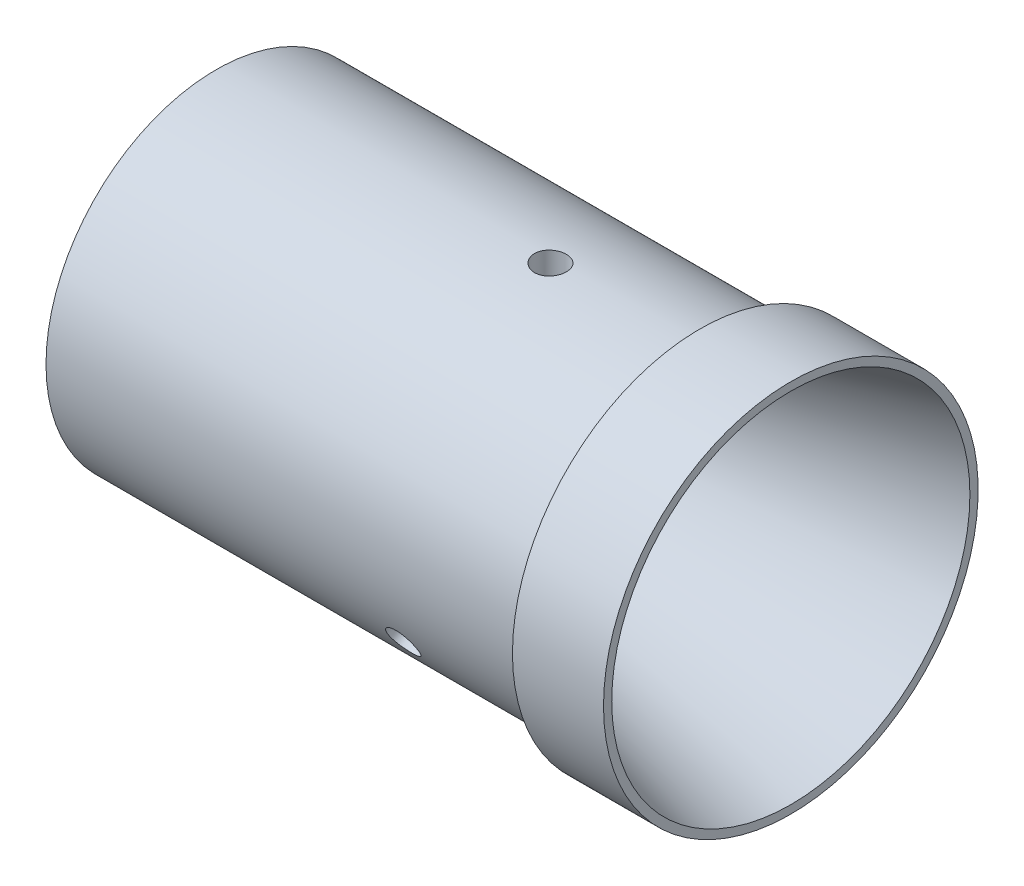
ISO-10303-21;
HEADER;
FILE_DESCRIPTION(('STEP AP214'),'2;1');
FILE_NAME('part.step','',(''),(''),'','','');
FILE_SCHEMA(('AUTOMOTIVE_DESIGN { 1 0 10303 214 1 1 1 1 }'));
ENDSEC;
DATA;
#1=APPLICATION_CONTEXT('core data for automotive mechanical design processes');
#2=APPLICATION_PROTOCOL_DEFINITION('international standard','automotive_design',2000,#1);
#3=PRODUCT_CONTEXT('',#1,'mechanical');
#4=PRODUCT('Part','Part','',(#3));
#5=PRODUCT_RELATED_PRODUCT_CATEGORY('part','',(#4));
#6=PRODUCT_DEFINITION_FORMATION('','',#4);
#7=PRODUCT_DEFINITION_CONTEXT('part definition',#1,'design');
#8=PRODUCT_DEFINITION('design','',#6,#7);
#9=PRODUCT_DEFINITION_SHAPE('','',#8);
#10=(LENGTH_UNIT() NAMED_UNIT(*) SI_UNIT(.MILLI.,.METRE.));
#11=(NAMED_UNIT(*) PLANE_ANGLE_UNIT() SI_UNIT($,.RADIAN.));
#12=(NAMED_UNIT(*) SI_UNIT($,.STERADIAN.) SOLID_ANGLE_UNIT());
#13=UNCERTAINTY_MEASURE_WITH_UNIT(LENGTH_MEASURE(1.E-05),#10,'distance_accuracy_value','');
#14=(GEOMETRIC_REPRESENTATION_CONTEXT(3) GLOBAL_UNCERTAINTY_ASSIGNED_CONTEXT((#13)) GLOBAL_UNIT_ASSIGNED_CONTEXT((#10,
#11,#12)) REPRESENTATION_CONTEXT('',''));
#15=CARTESIAN_POINT('',(0.,0.,0.));
#16=DIRECTION('',(0.,0.,1.));
#17=DIRECTION('',(1.,0.,0.));
#18=AXIS2_PLACEMENT_3D('',#15,#16,#17);
#19=CARTESIAN_POINT('',(0.,0.,0.));
#20=DIRECTION('',(-1.,0.,0.));
#21=DIRECTION('',(0.,0.,1.));
#22=AXIS2_PLACEMENT_3D('',#19,#20,#21);
#23=CYLINDRICAL_SURFACE('',#22,12.7);
#24=CARTESIAN_POINT('',(5.842,0.,0.));
#25=DIRECTION('',(-1.,0.,0.));
#26=DIRECTION('',(0.,0.,1.));
#27=AXIS2_PLACEMENT_3D('',#24,#25,#26);
#28=CIRCLE('',#27,12.7);
#29=CARTESIAN_POINT('',(5.842,0.,12.7));
#30=VERTEX_POINT('',#29);
#31=EDGE_CURVE('E90',#30,#30,#28,.T.);
#32=ORIENTED_EDGE('',*,*,#31,.F.);
#33=EDGE_LOOP('',(#32));
#34=FACE_BOUND('',#33,.T.);
#35=CARTESIAN_POINT('',(0.,0.,0.));
#36=DIRECTION('',(-1.,0.,0.));
#37=DIRECTION('',(0.,0.,1.));
#38=AXIS2_PLACEMENT_3D('',#35,#36,#37);
#39=CIRCLE('',#38,12.7);
#40=CARTESIAN_POINT('',(0.,0.,12.7));
#41=VERTEX_POINT('',#40);
#42=EDGE_CURVE('E134',#41,#41,#39,.T.);
#43=ORIENTED_EDGE('',*,*,#42,.T.);
#44=EDGE_LOOP('',(#43));
#45=FACE_BOUND('',#44,.T.);
#46=ADVANCED_FACE('F47',(#34,#45),#23,.F.);
#47=CARTESIAN_POINT('',(0.,12.7,0.));
#48=DIRECTION('',(1.,0.,0.));
#49=DIRECTION('',(0.,0.,-1.));
#50=AXIS2_PLACEMENT_3D('',#47,#48,#49);
#51=PLANE('',#50);
#52=ORIENTED_EDGE('',*,*,#42,.F.);
#53=EDGE_LOOP('',(#52));
#54=FACE_BOUND('',#53,.T.);
#55=CARTESIAN_POINT('',(0.,0.,0.));
#56=DIRECTION('',(-1.,0.,0.));
#57=DIRECTION('',(0.,0.,1.));
#58=AXIS2_PLACEMENT_3D('',#55,#56,#57);
#59=CIRCLE('',#58,14.478);
#60=CARTESIAN_POINT('',(0.,0.,14.478));
#61=VERTEX_POINT('',#60);
#62=EDGE_CURVE('E130',#61,#61,#59,.T.);
#63=ORIENTED_EDGE('',*,*,#62,.T.);
#64=EDGE_LOOP('',(#63));
#65=FACE_BOUND('',#64,.T.);
#66=ADVANCED_FACE('F200',(#54,#65),#51,.F.);
#67=CARTESIAN_POINT('',(0.,0.,0.));
#68=DIRECTION('',(-1.,0.,0.));
#69=DIRECTION('',(0.,0.,1.));
#70=AXIS2_PLACEMENT_3D('',#67,#68,#69);
#71=CYLINDRICAL_SURFACE('',#70,14.478);
#72=CARTESIAN_POINT('',(28.448,-6.0359989529651,-13.1597568609684));
#73=CARTESIAN_POINT('',(28.3722047397897,-6.03600222356383,-13.1597559353135));
#74=CARTESIAN_POINT('',(28.2963587451566,-6.0418372883581,-13.1570838354711));
#75=CARTESIAN_POINT('',(28.1467678224753,-6.0650023513697,-13.1464210636841));
#76=CARTESIAN_POINT('',(28.0730253327703,-6.08234516606279,-13.1384244616707));
#77=CARTESIAN_POINT('',(27.9298294946994,-6.12794358838118,-13.1172184468049));
#78=CARTESIAN_POINT('',(27.8603736442676,-6.15619275885688,-13.1040121087431));
#79=CARTESIAN_POINT('',(27.7276780805905,-6.22267691682936,-13.0725713496797));
#80=CARTESIAN_POINT('',(27.6644370971785,-6.26090985802163,-13.0543379589957));
#81=CARTESIAN_POINT('',(27.5457489932479,-6.34626767215661,-13.0130556718049));
#82=CARTESIAN_POINT('',(27.4903244747192,-6.3934174444241,-12.9899932709795));
#83=CARTESIAN_POINT('',(27.3890370498499,-6.49506304040762,-12.9394688676086));
#84=CARTESIAN_POINT('',(27.343174572689,-6.54955919367555,-12.9120066676819));
#85=CARTESIAN_POINT('',(27.262236040223,-6.66432701036899,-12.853147074866));
#86=CARTESIAN_POINT('',(27.2271798261091,-6.72460903423385,-12.8217425905885));
#87=CARTESIAN_POINT('',(27.1689758571841,-6.84903383866193,-12.7557114492584));
#88=CARTESIAN_POINT('',(27.1458278462284,-6.91317653614919,-12.7210848615319));
#89=CARTESIAN_POINT('',(27.1121632143776,-7.04321471183353,-12.6495493323078));
#90=CARTESIAN_POINT('',(27.1016096676814,-7.10910448420485,-12.6126473981588));
#91=CARTESIAN_POINT('',(27.0933193290292,-7.24089476748408,-12.5374511598312));
#92=CARTESIAN_POINT('',(27.0955822438438,-7.30679527811181,-12.4991568875279));
#93=CARTESIAN_POINT('',(27.1128305252929,-7.4365297035967,-12.4224061558767));
#94=CARTESIAN_POINT('',(27.1277761851088,-7.50036942352727,-12.3839505750324));
#95=CARTESIAN_POINT('',(27.1699038948802,-7.62444950196837,-12.3079466479785));
#96=CARTESIAN_POINT('',(27.197086086293,-7.68468981885981,-12.270398312262));
#97=CARTESIAN_POINT('',(27.2629590918541,-7.80006754889445,-12.1973810166705));
#98=CARTESIAN_POINT('',(27.3016675650954,-7.85519696057067,-12.1619153481375));
#99=CARTESIAN_POINT('',(27.389481521266,-7.95883902614255,-12.0943457366585));
#100=CARTESIAN_POINT('',(27.4385872700151,-8.00735151081578,-12.062241879693));
#101=CARTESIAN_POINT('',(27.5460253567886,-8.09672468071775,-12.0024348501245));
#102=CARTESIAN_POINT('',(27.6043922201156,-8.13755543151054,-11.9747489546672));
#103=CARTESIAN_POINT('',(27.72857575616,-8.2103314930062,-11.9249692258591));
#104=CARTESIAN_POINT('',(27.7943924375597,-8.24227679335358,-11.9028753990255));
#105=CARTESIAN_POINT('',(27.9316329222978,-8.29650847506884,-11.8651391972121));
#106=CARTESIAN_POINT('',(28.0030576872199,-8.31879319570579,-11.8494979315015));
#107=CARTESIAN_POINT('',(28.1494743726703,-8.35315136005179,-11.825303033636));
#108=CARTESIAN_POINT('',(28.2244661985507,-8.36522507453888,-11.8167492135345));
#109=CARTESIAN_POINT('',(28.3755852513339,-8.37884071892452,-11.8070988365785));
#110=CARTESIAN_POINT('',(28.4517071245171,-8.38042222750482,-11.8059742552298));
#111=CARTESIAN_POINT('',(28.6031915296032,-8.37312013309166,-11.8111541557813));
#112=CARTESIAN_POINT('',(28.678554070429,-8.3642366532172,-11.8174585502808));
#113=CARTESIAN_POINT('',(28.8262406773075,-8.33624674392824,-11.8372194292417));
#114=CARTESIAN_POINT('',(28.8985700351261,-8.31715899190603,-11.850662846493));
#115=CARTESIAN_POINT('',(29.0383013647468,-8.26923316460915,-11.8841540105515));
#116=CARTESIAN_POINT('',(29.1057032376325,-8.24039489366399,-11.9042018898951));
#117=CARTESIAN_POINT('',(29.2338867690621,-8.17356284433145,-11.9501882166));
#118=CARTESIAN_POINT('',(29.2946481144745,-8.13554205610758,-11.9761440285917));
#119=CARTESIAN_POINT('',(29.4076200968198,-8.05131548295241,-12.032928819272));
#120=CARTESIAN_POINT('',(29.4598305489788,-8.00510952119484,-12.0637579032376));
#121=CARTESIAN_POINT('',(29.5543844980509,-7.90549827590579,-12.129267858723));
#122=CARTESIAN_POINT('',(29.5966965464624,-7.85207087495514,-12.1639605034848));
#123=CARTESIAN_POINT('',(29.6700364595995,-7.73949422953969,-12.2358967418841));
#124=CARTESIAN_POINT('',(29.7010644617027,-7.68034505474567,-12.273140304459));
#125=CARTESIAN_POINT('',(29.7509019232963,-7.55798513106983,-12.3488667050142));
#126=CARTESIAN_POINT('',(29.7697305653754,-7.4947809312749,-12.3873474970301));
#127=CARTESIAN_POINT('',(29.7946974740487,-7.36595662826301,-12.4643811186406));
#128=CARTESIAN_POINT('',(29.8008360487488,-7.30033658374046,-12.5029339464635));
#129=CARTESIAN_POINT('',(29.8002445519433,-7.16878686387581,-12.578820432716));
#130=CARTESIAN_POINT('',(29.7935633794908,-7.10285931816192,-12.6161581735575));
#131=CARTESIAN_POINT('',(29.7676243450641,-6.97234697759748,-12.6887524908188));
#132=CARTESIAN_POINT('',(29.7483664699588,-6.90776218414894,-12.7240090650658));
#133=CARTESIAN_POINT('',(29.6978337873334,-6.78184139208466,-12.7915683323736));
#134=CARTESIAN_POINT('',(29.6665601877694,-6.72050506760124,-12.823871321958));
#135=CARTESIAN_POINT('',(29.5928891374838,-6.60290698887617,-12.8848164542768));
#136=CARTESIAN_POINT('',(29.5504917977001,-6.54664518403346,-12.9134586335166));
#137=CARTESIAN_POINT('',(29.4555931843758,-6.44070790362054,-12.9666224303115));
#138=CARTESIAN_POINT('',(29.4030555630459,-6.39105724146861,-12.9911286115236));
#139=CARTESIAN_POINT('',(29.2894374508729,-6.30011955923017,-13.0354725384048));
#140=CARTESIAN_POINT('',(29.2283549054862,-6.2588345564476,-13.055309158237));
#141=CARTESIAN_POINT('',(29.0992325827275,-6.185874389795,-13.0900375649578));
#142=CARTESIAN_POINT('',(29.0311773910321,-6.15422115937487,-13.1049180729727));
#143=CARTESIAN_POINT('',(28.8901980086407,-6.10171392326439,-13.1294485342047));
#144=CARTESIAN_POINT('',(28.8172794610703,-6.08084763900675,-13.1391044350758));
#145=CARTESIAN_POINT('',(28.6946172417719,-6.05584699382323,-13.1506392135606));
#146=CARTESIAN_POINT('',(28.6456598025805,-6.0484152975243,-13.1540559003851));
#147=CARTESIAN_POINT('',(28.5471421442624,-6.03849021610064,-13.1586150228224));
#148=CARTESIAN_POINT('',(28.4975819272715,-6.03599681348319,-13.1597574664911));
#149=CARTESIAN_POINT('',(28.448,-6.0359989529651,-13.1597568609684));
#150=B_SPLINE_CURVE_WITH_KNOTS('',3,(#72,#73,#74,#75,#76,#77,#78,#79,#80,#81,#82,#83,#84,#85,
#86,#87,#88,#89,#90,#91,#92,#93,#94,#95,#96,#97,#98,#99,#100,#101,#102,#103,#104,#105,#106,#107,
#108,#109,#110,#111,#112,#113,#114,#115,#116,#117,#118,#119,#120,#121,#122,#123,#124,#125,#126,
#127,#128,#129,#130,#131,#132,#133,#134,#135,#136,#137,#138,#139,#140,#141,#142,#143,#144,#145,
#146,#147,#148,#149),.UNSPECIFIED.,.T.,.F.,(4,2,2,2,2,2,2,2,2,2,2,2,2,2,2,2,2,2,2,2,2,2,2,2,2,2,
2,2,2,2,2,2,2,2,2,2,2,2,4),(0.,0.227204729547534,0.454662928496551,0.681987081793339,
0.909264678550434,1.13718655450451,1.36511865822847,1.59346680505561,1.82181003992595,
2.04948213580581,2.27714902277105,2.5041057545581,2.73106511008639,2.95837398857022,
3.18568867920131,3.41387161698589,3.64205482070412,3.87027723540056,4.09849359784795,
4.32584859100829,4.55320090939869,4.78013851106308,5.00708066711419,5.23469866921022,
5.46232158919207,5.6906581619766,5.91899195478599,6.14696583264789,6.37493417539685,
6.6020346944924,6.82913545069783,7.05621338214548,7.28328904901272,7.51119431340581,
7.73915446988429,7.96762991746202,8.19584472012083,8.34447259275487,8.4930999389095),.UNSPECIFIED.);
#151=CARTESIAN_POINT('',(28.448,-6.0359989529651,-13.1597568609684));
#152=VERTEX_POINT('',#151);
#153=EDGE_CURVE('E11',#152,#152,#150,.T.);
#154=ORIENTED_EDGE('',*,*,#153,.T.);
#155=EDGE_LOOP('',(#154));
#156=FACE_BOUND('',#155,.T.);
#157=CARTESIAN_POINT('',(28.448,-8.37868427274257,11.8072068609683));
#158=CARTESIAN_POINT('',(28.3722047397897,-8.37868183580256,11.8072092305624));
#159=CARTESIAN_POINT('',(28.2963587451566,-8.37345019706044,11.8109264949858));
#160=CARTESIAN_POINT('',(28.1467678224753,-8.35263343431239,11.8256566421406));
#161=CARTESIAN_POINT('',(28.0730253327703,-8.33703676647829,11.8366776592313));
#162=CARTESIAN_POINT('',(27.9298294946994,-8.29587260773229,11.8655640438986));
#163=CARTESIAN_POINT('',(27.8603736442676,-8.27031099824195,11.8834253741355));
#164=CARTESIAN_POINT('',(27.7276780805905,-8.20984042319255,11.9252819643572));
#165=CARTESIAN_POINT('',(27.6644370971785,-8.17493337306691,11.9492759673491));
#166=CARTESIAN_POINT('',(27.5457489932479,-8.09650295656586,12.002556859206));
#167=CARTESIAN_POINT('',(27.4903244747192,-8.05295544544504,12.0318585593596));
#168=CARTESIAN_POINT('',(27.3890370498499,-7.95837723062308,12.0946240259788));
#169=CARTESIAN_POINT('',(27.343174572689,-7.90734619120872,12.1280879791539));
#170=CARTESIAN_POINT('',(27.262236040223,-7.79898838022703,12.1980500275394));
#171=CARTESIAN_POINT('',(27.2271798261091,-7.74165028711754,12.2345535494591));
#172=CARTESIAN_POINT('',(27.1689758571841,-7.62225323907075,12.3092930202897));
#173=CARTESIAN_POINT('',(27.1458278462284,-7.56019438570962,12.3475289319177));
#174=CARTESIAN_POINT('',(27.1121632143776,-7.4332237122862,12.4243775309101));
#175=CARTESIAN_POINT('',(27.1016096676814,-7.36832081367873,12.4629887805587));
#176=CARTESIAN_POINT('',(27.0933193290292,-7.23730381937836,12.5395243946866));
#177=CARTESIAN_POINT('',(27.0955822438438,-7.17118975143044,12.577448774861));
#178=CARTESIAN_POINT('',(27.1128305252929,-7.03985445531898,12.6514267172507));
#179=CARTESIAN_POINT('',(27.1277761851088,-6.97463108542531,12.6874857460589));
#180=CARTESIAN_POINT('',(27.1699038948802,-6.84676971458866,12.7569402825655));
#181=CARTESIAN_POINT('',(27.197086086293,-6.78413174354265,12.7903357594673));
#182=CARTESIAN_POINT('',(27.2629590918541,-6.6632080456274,12.8537471569125));
#183=CARTESIAN_POINT('',(27.3016675650954,-6.60492916987752,12.8837577936533));
#184=CARTESIAN_POINT('',(27.389481521266,-6.49459113702696,12.9397296495997));
#185=CARTESIAN_POINT('',(27.4385872700151,-6.44253213899874,12.9656907652447));
#186=CARTESIAN_POINT('',(27.5460253567886,-6.34605114711655,13.0131866860123));
#187=CARTESIAN_POINT('',(27.6043922201156,-6.3016590829276,13.0347042057258));
#188=CARTESIAN_POINT('',(27.72857575616,-6.22216054243844,13.0728402593644));
#189=CARTESIAN_POINT('',(27.7943924375597,-6.18705407696008,13.0894587875799));
#190=CARTESIAN_POINT('',(27.9316329222978,-6.1272577266897,13.1175567007286));
#191=CARTESIAN_POINT('',(28.0030576872199,-6.10256963291848,13.1290352020611));
#192=CARTESIAN_POINT('',(28.1494743726703,-6.06443715455197,13.1466927962794));
#193=CARTESIAN_POINT('',(28.2244661985507,-6.05099247180119,13.1528720296925));
#194=CARTESIAN_POINT('',(28.3755852513339,-6.03582717800834,13.1598383351414));
#195=CARTESIAN_POINT('',(28.4517071245171,-6.03406250770161,13.1606456710739));
#196=CARTESIAN_POINT('',(28.6031915296032,-6.04219948037488,13.156911822087));
#197=CARTESIAN_POINT('',(28.678554070429,-6.05210098610412,13.1523707000915));
#198=CARTESIAN_POINT('',(28.8262406773075,-6.0832093639299,13.1380111670781));
#199=CARTESIAN_POINT('',(28.8985700351261,-6.10439558079424,13.1282023975513));
#200=CARTESIAN_POINT('',(29.0383013647468,-6.15736269331971,13.1034429956441));
#201=CARTESIAN_POINT('',(29.1057032376325,-6.18914380159579,13.0884922600761));
#202=CARTESIAN_POINT('',(29.2338867690621,-6.26238515341531,13.0536071709197));
#203=CARTESIAN_POINT('',(29.2946481144745,-6.30387394008784,13.0336581084417));
#204=CARTESIAN_POINT('',(29.4076200968198,-6.39516429794319,12.9891081517558));
#205=CARTESIAN_POINT('',(29.4598305489788,-6.44496604871161,12.9645071570503));
#206=CARTESIAN_POINT('',(29.5543844980509,-6.55150495700728,12.91099626587));
#207=CARTESIAN_POINT('',(29.5966965464624,-6.60826336917075,12.8820731017695));
#208=CARTESIAN_POINT('',(29.6700364595995,-6.72685030178497,12.8205469861665));
#209=CARTESIAN_POINT('',(29.7010644617027,-6.78867876049924,12.7879440794694));
#210=CARTESIAN_POINT('',(29.7509019232963,-6.91543970895516,12.7198404774387));
#211=CARTESIAN_POINT('',(29.7697305653754,-6.98036715229613,12.6843444307983));
#212=CARTESIAN_POINT('',(29.7946974740487,-7.11149237706228,12.6112961225705));
#213=CARTESIAN_POINT('',(29.8008360487488,-7.17769012760589,12.5737439109279));
#214=CARTESIAN_POINT('',(29.8002445519433,-7.3091846124369,12.4977617547907));
#215=CARTESIAN_POINT('',(29.7935633794908,-7.37448381738244,12.459335695814));
#216=CARTESIAN_POINT('',(29.7676243450641,-7.50260851058337,12.3826058520085));
#217=CARTESIAN_POINT('',(29.7483664699588,-7.56543399625593,12.3443020673074));
#218=CARTESIAN_POINT('',(29.6978337873334,-7.68690243403766,12.2690310961689));
#219=CARTESIAN_POINT('',(29.6665601877694,-7.74554580587768,12.2320637757838));
#220=CARTESIAN_POINT('',(29.5928891374838,-7.85712487806534,12.160693418331));
#221=CARTESIAN_POINT('',(29.5504917977001,-7.91006063532806,12.1262903556944));
#222=CARTESIAN_POINT('',(29.4555931843758,-8.00907047412054,12.0611278780464));
#223=CARTESIAN_POINT('',(29.4030555630459,-8.05511878067592,12.0303822339141));
#224=CARTESIAN_POINT('',(29.2894374508729,-8.13899058897782,11.973799854375));
#225=CARTESIAN_POINT('',(29.2283549054862,-8.17681210706901,11.9479643030861));
#226=CARTESIAN_POINT('',(29.0992325827275,-8.24336787284851,11.902143148661));
#227=CARTESIAN_POINT('',(29.0311773910321,-8.27208138602065,11.8821709010127));
#228=CARTESIAN_POINT('',(28.8901980086407,-8.31957900666934,11.8489635312745));
#229=CARTESIAN_POINT('',(28.8172794610703,-8.33837440424897,11.8357207494604));
#230=CARTESIAN_POINT('',(28.6946172417719,-8.36086413803559,11.8198369448629));
#231=CARTESIAN_POINT('',(28.6456598025805,-8.36753892377191,11.8151092504871));
#232=CARTESIAN_POINT('',(28.5471421442624,-8.3764497803334,11.8087934390582));
#233=CARTESIAN_POINT('',(28.4975819272715,-8.37868586688159,11.807205310884));
#234=CARTESIAN_POINT('',(28.448,-8.37868427274257,11.8072068609683));
#235=B_SPLINE_CURVE_WITH_KNOTS('',3,(#157,#158,#159,#160,#161,#162,#163,#164,#165,#166,#167,
#168,#169,#170,#171,#172,#173,#174,#175,#176,#177,#178,#179,#180,#181,#182,#183,#184,#185,#186,
#187,#188,#189,#190,#191,#192,#193,#194,#195,#196,#197,#198,#199,#200,#201,#202,#203,#204,#205,
#206,#207,#208,#209,#210,#211,#212,#213,#214,#215,#216,#217,#218,#219,#220,#221,#222,#223,#224,
#225,#226,#227,#228,#229,#230,#231,#232,#233,#234),.UNSPECIFIED.,.T.,.F.,(4,2,2,2,2,2,2,2,2,2,2,
2,2,2,2,2,2,2,2,2,2,2,2,2,2,2,2,2,2,2,2,2,2,2,2,2,2,2,4),(0.,0.227204729547534,
0.454662928496551,0.681987081793339,0.909264678550434,1.13718655450451,1.36511865822847,
1.59346680505561,1.82181003992595,2.04948213580581,2.27714902277105,2.5041057545581,
2.73106511008639,2.95837398857021,3.18568867920131,3.4138716169859,3.64205482070413,
3.87027723540056,4.09849359784795,4.32584859100829,4.55320090939869,4.78013851106308,
5.0070806671142,5.23469866921022,5.46232158919207,5.6906581619766,5.91899195478599,
6.14696583264789,6.37493417539685,6.6020346944924,6.82913545069783,7.05621338214548,
7.28328904901271,7.51119431340581,7.73915446988429,7.96762991746203,8.19584472012083,
8.34447259275487,8.4930999389095),.UNSPECIFIED.);
#236=CARTESIAN_POINT('',(28.448,-8.37868427274257,11.8072068609683));
#237=VERTEX_POINT('',#236);
#238=EDGE_CURVE('E60',#237,#237,#235,.T.);
#239=ORIENTED_EDGE('',*,*,#238,.T.);
#240=EDGE_LOOP('',(#239));
#241=FACE_BOUND('',#240,.T.);
#242=CARTESIAN_POINT('',(28.448,14.4146832257077,1.35255));
#243=CARTESIAN_POINT('',(28.3722047397897,14.4146840593665,1.35254670475098));
#244=CARTESIAN_POINT('',(28.2963587451566,14.4152874854186,1.3461573404852));
#245=CARTESIAN_POINT('',(28.1467678224753,14.4176357856822,1.32076442154342));
#246=CARTESIAN_POINT('',(28.0730253327703,14.4193819325411,1.30174680243937));
#247=CARTESIAN_POINT('',(27.9298294946994,14.4238161961135,1.25165440290626));
#248=CARTESIAN_POINT('',(27.8603736442676,14.4265037570989,1.22058673460757));
#249=CARTESIAN_POINT('',(27.7276780805905,14.432517340022,1.14728938532249));
#250=CARTESIAN_POINT('',(27.6644370971785,14.4358432310886,1.10506199164656));
#251=CARTESIAN_POINT('',(27.5457489932479,14.4427706287225,1.01049881259876));
#252=CARTESIAN_POINT('',(27.4903244747192,14.4463728898692,0.958134711619752));
#253=CARTESIAN_POINT('',(27.3890370498499,14.4534402710308,0.84484484162979));
#254=CARTESIAN_POINT('',(27.343174572689,14.4569053848843,0.783918688527851));
#255=CARTESIAN_POINT('',(27.262236040223,14.4633153905961,0.655097047326507));
#256=CARTESIAN_POINT('',(27.2271798261091,14.4662593213515,0.587189041129247));
#257=CARTESIAN_POINT('',(27.1689758571841,14.4712870777327,0.446418428968573));
#258=CARTESIAN_POINT('',(27.1458278462284,14.4733709218589,0.373555929614105));
#259=CARTESIAN_POINT('',(27.1121632143776,14.4764384241198,0.225171801397624));
#260=CARTESIAN_POINT('',(27.1016096676814,14.4774252978836,0.14965861759999));
#261=CARTESIAN_POINT('',(27.0933193290292,14.4781985868625,-0.00207323485558346));
#262=CARTESIAN_POINT('',(27.0955822438438,14.4779850295423,-0.0782918873331938));
#263=CARTESIAN_POINT('',(27.1128305252929,14.4763841589157,-0.229020561374102));
#264=CARTESIAN_POINT('',(27.1277761851088,14.4750005089526,-0.303535171026577));
#265=CARTESIAN_POINT('',(27.1699038948802,14.4712192165571,-0.448993634587107));
#266=CARTESIAN_POINT('',(27.197086086293,14.4688215624025,-0.519937447205358));
#267=CARTESIAN_POINT('',(27.2629590918541,14.4632755945219,-0.656366140242117));
#268=CARTESIAN_POINT('',(27.3016675650954,14.4601261304482,-0.721842445515906));
#269=CARTESIAN_POINT('',(27.389481521266,14.4534301631696,-0.845383912941326));
#270=CARTESIAN_POINT('',(27.4385872700151,14.4498836498146,-0.903448885551807));
#271=CARTESIAN_POINT('',(27.5460253567886,14.4427758278344,-1.01075183588791));
#272=CARTESIAN_POINT('',(27.6043922201156,14.4392145144382,-1.05995525105871));
#273=CARTESIAN_POINT('',(27.72857575616,14.4324920354447,-1.1478710335054));
#274=CARTESIAN_POINT('',(27.7943924375597,14.4293308703137,-1.18658338855452));
#275=CARTESIAN_POINT('',(27.9316329222978,14.4237662017586,-1.25241750351659));
#276=CARTESIAN_POINT('',(28.0030576872199,14.4213628286243,-1.27953727055974));
#277=CARTESIAN_POINT('',(28.1494743726703,14.4175885146038,-1.32138976264354));
#278=CARTESIAN_POINT('',(28.2244661985507,14.4162175463401,-1.33612281615811));
#279=CARTESIAN_POINT('',(28.3755852513339,14.4146678969329,-1.35273949856299));
#280=CARTESIAN_POINT('',(28.4517071245171,14.4144847352065,-1.35467141584418));
#281=CARTESIAN_POINT('',(28.6031915296032,14.4153196134666,-1.34575766630579));
#282=CARTESIAN_POINT('',(28.678554070429,14.4163376393214,-1.33491214981077));
#283=CARTESIAN_POINT('',(28.8262406773075,14.4194561078582,-1.30079173783643));
#284=CARTESIAN_POINT('',(28.8985700351261,14.4215545727003,-1.27753955105844));
#285=CARTESIAN_POINT('',(29.0383013647468,14.4265958579289,-1.21928898509268));
#286=CARTESIAN_POINT('',(29.1057032376325,14.4295386952598,-1.18429037018119));
#287=CARTESIAN_POINT('',(29.2338867690621,14.4359479977468,-1.10341895431973));
#288=CARTESIAN_POINT('',(29.2946481144745,14.4394159961955,-1.05751407985015));
#289=CARTESIAN_POINT('',(29.4076200968198,14.4464797808956,-0.956179332483887));
#290=CARTESIAN_POINT('',(29.4598305489788,14.4500755699065,-0.900749253812729));
#291=CARTESIAN_POINT('',(29.5543844980509,14.4570032329131,-0.781728407147107));
#292=CARTESIAN_POINT('',(29.5966965464624,14.4603342441259,-0.718112598284799));
#293=CARTESIAN_POINT('',(29.6700364595995,14.4663445313247,-0.584650244282528));
#294=CARTESIAN_POINT('',(29.7010644617027,14.469023815245,-0.514803775010591));
#295=CARTESIAN_POINT('',(29.7509019232963,14.4734248400251,-0.370973772424568));
#296=CARTESIAN_POINT('',(29.7697305653754,14.4751480835711,-0.296996933768347));
#297=CARTESIAN_POINT('',(29.7946974740487,14.4774490053253,-0.146915003929978));
#298=CARTESIAN_POINT('',(29.8008360487488,14.4780267113464,-0.0708099644645456));
#299=CARTESIAN_POINT('',(29.8002445519433,14.4779714763128,0.0810586779252601));
#300=CARTESIAN_POINT('',(29.7935633794908,14.4773431355444,0.156822477743368));
#301=CARTESIAN_POINT('',(29.7676243450641,14.4749554881809,0.306146638810207));
#302=CARTESIAN_POINT('',(29.7483664699588,14.4731961804049,0.379706997758302));
#303=CARTESIAN_POINT('',(29.6978337873334,14.4687438261224,0.522537236204508));
#304=CARTESIAN_POINT('',(29.6665601877694,14.466050873479,0.591807546174136));
#305=CARTESIAN_POINT('',(29.5928891374838,14.4600318669416,0.72412303594571));
#306=CARTESIAN_POINT('',(29.5504917977001,14.4567058193616,0.787168277822132));
#307=CARTESIAN_POINT('',(29.4555931843758,14.4497783777411,0.905494552265009));
#308=CARTESIAN_POINT('',(29.4030555630459,14.4461760221446,0.96074637760934));
#309=CARTESIAN_POINT('',(29.2894374508729,14.4391101482081,1.06167268402971));
#310=CARTESIAN_POINT('',(29.2283549054862,14.4356466635167,1.10734485515083));
#311=CARTESIAN_POINT('',(29.0992325827275,14.4292422626436,1.18789441629674));
#312=CARTESIAN_POINT('',(29.0311773910321,14.4263025453956,1.22274717195985));
#313=CARTESIAN_POINT('',(28.8901980086407,14.4212929299338,1.28048500293002));
#314=CARTESIAN_POINT('',(28.8172794610703,14.4192220432558,1.30338368561528));
#315=CARTESIAN_POINT('',(28.6946172417719,14.4167111318589,1.3308022686976));
#316=CARTESIAN_POINT('',(28.6456598025805,14.4159542212963,1.33894664989798));
#317=CARTESIAN_POINT('',(28.5471421442624,14.4149399964341,1.34982158376414));
#318=CARTESIAN_POINT('',(28.4975819272715,14.4146826803648,1.35255215560705));
#319=CARTESIAN_POINT('',(28.448,14.4146832257077,1.35255));
#320=B_SPLINE_CURVE_WITH_KNOTS('',3,(#242,#243,#244,#245,#246,#247,#248,#249,#250,#251,#252,
#253,#254,#255,#256,#257,#258,#259,#260,#261,#262,#263,#264,#265,#266,#267,#268,#269,#270,#271,
#272,#273,#274,#275,#276,#277,#278,#279,#280,#281,#282,#283,#284,#285,#286,#287,#288,#289,#290,
#291,#292,#293,#294,#295,#296,#297,#298,#299,#300,#301,#302,#303,#304,#305,#306,#307,#308,#309,
#310,#311,#312,#313,#314,#315,#316,#317,#318,#319),.UNSPECIFIED.,.T.,.F.,(4,2,2,2,2,2,2,2,2,2,2,
2,2,2,2,2,2,2,2,2,2,2,2,2,2,2,2,2,2,2,2,2,2,2,2,2,2,2,4),(0.,0.227204729547534,
0.454662928496551,0.681987081793339,0.909264678550434,1.13718655450452,1.36511865822847,
1.59346680505561,1.82181003992595,2.04948213580581,2.27714902277105,2.5041057545581,
2.73106511008639,2.95837398857021,3.18568867920131,3.41387161698589,3.64205482070412,
3.87027723540056,4.09849359784795,4.32584859100828,4.55320090939869,4.78013851106308,
5.0070806671142,5.23469866921023,5.46232158919207,5.69065816197659,5.91899195478599,
6.14696583264789,6.37493417539685,6.6020346944924,6.82913545069783,7.05621338214548,
7.28328904901272,7.51119431340581,7.73915446988429,7.96762991746202,8.19584472012083,
8.34447259275487,8.4930999389095),.UNSPECIFIED.);
#321=CARTESIAN_POINT('',(28.448,14.4146832257077,1.35255));
#322=VERTEX_POINT('',#321);
#323=EDGE_CURVE('E138',#322,#322,#320,.T.);
#324=ORIENTED_EDGE('',*,*,#323,.T.);
#325=EDGE_LOOP('',(#324));
#326=FACE_BOUND('',#325,.T.);
#327=ORIENTED_EDGE('',*,*,#62,.F.);
#328=EDGE_LOOP('',(#327));
#329=FACE_BOUND('',#328,.T.);
#330=CARTESIAN_POINT('',(41.148,0.,0.));
#331=DIRECTION('',(-1.,0.,0.));
#332=DIRECTION('',(0.,0.,1.));
#333=AXIS2_PLACEMENT_3D('',#330,#331,#332);
#334=CIRCLE('',#333,14.478);
#335=CARTESIAN_POINT('',(41.148,0.,14.478));
#336=VERTEX_POINT('',#335);
#337=EDGE_CURVE('E126',#336,#336,#334,.T.);
#338=ORIENTED_EDGE('',*,*,#337,.T.);
#339=EDGE_LOOP('',(#338));
#340=FACE_BOUND('',#339,.T.);
#341=ADVANCED_FACE('F149',(#156,#241,#326,#329,#340),#71,.T.);
#342=CARTESIAN_POINT('',(41.148,14.478,0.));
#343=DIRECTION('',(1.,0.,0.));
#344=DIRECTION('',(0.,0.,-1.));
#345=AXIS2_PLACEMENT_3D('',#342,#343,#344);
#346=PLANE('',#345);
#347=ORIENTED_EDGE('',*,*,#337,.F.);
#348=EDGE_LOOP('',(#347));
#349=FACE_BOUND('',#348,.T.);
#350=CARTESIAN_POINT('',(41.148,0.,0.));
#351=DIRECTION('',(-1.,0.,0.));
#352=DIRECTION('',(0.,0.,1.));
#353=AXIS2_PLACEMENT_3D('',#350,#351,#352);
#354=CIRCLE('',#353,15.9385);
#355=CARTESIAN_POINT('',(41.148,0.,15.9385));
#356=VERTEX_POINT('',#355);
#357=EDGE_CURVE('E122',#356,#356,#354,.T.);
#358=ORIENTED_EDGE('',*,*,#357,.T.);
#359=EDGE_LOOP('',(#358));
#360=FACE_BOUND('',#359,.T.);
#361=ADVANCED_FACE('F193',(#349,#360),#346,.F.);
#362=CARTESIAN_POINT('',(0.,0.,0.));
#363=DIRECTION('',(-1.,0.,0.));
#364=DIRECTION('',(0.,0.,1.));
#365=AXIS2_PLACEMENT_3D('',#362,#363,#364);
#366=CYLINDRICAL_SURFACE('',#365,15.9385);
#367=ORIENTED_EDGE('',*,*,#357,.F.);
#368=EDGE_LOOP('',(#367));
#369=FACE_BOUND('',#368,.T.);
#370=CARTESIAN_POINT('',(48.895,0.,0.));
#371=DIRECTION('',(-1.,0.,0.));
#372=DIRECTION('',(0.,0.,1.));
#373=AXIS2_PLACEMENT_3D('',#370,#371,#372);
#374=CIRCLE('',#373,15.9385);
#375=CARTESIAN_POINT('',(48.895,0.,15.9385));
#376=VERTEX_POINT('',#375);
#377=EDGE_CURVE('E118',#376,#376,#374,.T.);
#378=ORIENTED_EDGE('',*,*,#377,.T.);
#379=EDGE_LOOP('',(#378));
#380=FACE_BOUND('',#379,.T.);
#381=ADVANCED_FACE('F190',(#369,#380),#366,.T.);
#382=CARTESIAN_POINT('',(48.895,15.9385,0.));
#383=DIRECTION('',(-1.,0.,0.));
#384=DIRECTION('',(0.,0.,1.));
#385=AXIS2_PLACEMENT_3D('',#382,#383,#384);
#386=PLANE('',#385);
#387=ORIENTED_EDGE('',*,*,#377,.F.);
#388=EDGE_LOOP('',(#387));
#389=FACE_BOUND('',#388,.T.);
#390=CARTESIAN_POINT('',(48.895,0.,0.));
#391=DIRECTION('',(-1.,0.,0.));
#392=DIRECTION('',(0.,0.,1.));
#393=AXIS2_PLACEMENT_3D('',#390,#391,#392);
#394=CIRCLE('',#393,15.2372435608016);
#395=CARTESIAN_POINT('',(48.895,0.,15.2372435608016));
#396=VERTEX_POINT('',#395);
#397=EDGE_CURVE('E114',#396,#396,#394,.T.);
#398=ORIENTED_EDGE('',*,*,#397,.T.);
#399=EDGE_LOOP('',(#398));
#400=FACE_BOUND('',#399,.T.);
#401=ADVANCED_FACE('F186',(#389,#400),#386,.F.);
#402=CARTESIAN_POINT('',(24.638,0.,0.));
#403=DIRECTION('',(1.,0.,0.));
#404=DIRECTION('',(0.,0.,-1.));
#405=AXIS2_PLACEMENT_3D('',#402,#403,#404);
#406=CONICAL_SURFACE('',#405,8.7376,0.261799387799143);
#407=ORIENTED_EDGE('',*,*,#397,.F.);
#408=EDGE_LOOP('',(#407));
#409=FACE_BOUND('',#408,.T.);
#410=CARTESIAN_POINT('',(24.638,0.,0.));
#411=DIRECTION('',(-1.,0.,0.));
#412=DIRECTION('',(0.,0.,1.));
#413=AXIS2_PLACEMENT_3D('',#410,#411,#412);
#414=CIRCLE('',#413,8.7376);
#415=CARTESIAN_POINT('',(24.638,0.,8.7376));
#416=VERTEX_POINT('',#415);
#417=EDGE_CURVE('E110',#416,#416,#414,.T.);
#418=ORIENTED_EDGE('',*,*,#417,.T.);
#419=EDGE_LOOP('',(#418));
#420=FACE_BOUND('',#419,.T.);
#421=ADVANCED_FACE('F182',(#409,#420),#406,.F.);
#422=CARTESIAN_POINT('',(24.638,8.7376,0.));
#423=DIRECTION('',(1.,0.,0.));
#424=DIRECTION('',(0.,0.,-1.));
#425=AXIS2_PLACEMENT_3D('',#422,#423,#424);
#426=PLANE('',#425);
#427=ORIENTED_EDGE('',*,*,#417,.F.);
#428=EDGE_LOOP('',(#427));
#429=FACE_BOUND('',#428,.T.);
#430=CARTESIAN_POINT('',(24.638,0.,0.));
#431=DIRECTION('',(-1.,0.,0.));
#432=DIRECTION('',(0.,0.,1.));
#433=AXIS2_PLACEMENT_3D('',#430,#431,#432);
#434=CIRCLE('',#433,10.3251);
#435=CARTESIAN_POINT('',(24.638,0.,10.3251));
#436=VERTEX_POINT('',#435);
#437=EDGE_CURVE('E106',#436,#436,#434,.T.);
#438=ORIENTED_EDGE('',*,*,#437,.T.);
#439=EDGE_LOOP('',(#438));
#440=FACE_BOUND('',#439,.T.);
#441=ADVANCED_FACE('F178',(#429,#440),#426,.F.);
#442=CARTESIAN_POINT('',(0.,0.,0.));
#443=DIRECTION('',(-1.,0.,0.));
#444=DIRECTION('',(0.,0.,1.));
#445=AXIS2_PLACEMENT_3D('',#442,#443,#444);
#446=CYLINDRICAL_SURFACE('',#445,10.3251);
#447=ORIENTED_EDGE('',*,*,#437,.F.);
#448=EDGE_LOOP('',(#447));
#449=FACE_BOUND('',#448,.T.);
#450=CARTESIAN_POINT('',(7.62,0.,0.));
#451=DIRECTION('',(-1.,0.,0.));
#452=DIRECTION('',(0.,0.,1.));
#453=AXIS2_PLACEMENT_3D('',#450,#451,#452);
#454=CIRCLE('',#453,10.3251);
#455=CARTESIAN_POINT('',(7.62,0.,10.3251));
#456=VERTEX_POINT('',#455);
#457=EDGE_CURVE('E102',#456,#456,#454,.T.);
#458=ORIENTED_EDGE('',*,*,#457,.T.);
#459=EDGE_LOOP('',(#458));
#460=FACE_BOUND('',#459,.T.);
#461=ADVANCED_FACE('F174',(#449,#460),#446,.F.);
#462=CARTESIAN_POINT('',(7.62,10.3251,0.));
#463=DIRECTION('',(1.,0.,0.));
#464=DIRECTION('',(0.,0.,-1.));
#465=AXIS2_PLACEMENT_3D('',#462,#463,#464);
#466=PLANE('',#465);
#467=ORIENTED_EDGE('',*,*,#457,.F.);
#468=EDGE_LOOP('',(#467));
#469=FACE_BOUND('',#468,.T.);
#470=CARTESIAN_POINT('',(7.62,0.,0.));
#471=DIRECTION('',(-1.,0.,0.));
#472=DIRECTION('',(0.,0.,1.));
#473=AXIS2_PLACEMENT_3D('',#470,#471,#472);
#474=CIRCLE('',#473,11.1633);
#475=CARTESIAN_POINT('',(7.62,0.,11.1633));
#476=VERTEX_POINT('',#475);
#477=EDGE_CURVE('E98',#476,#476,#474,.T.);
#478=ORIENTED_EDGE('',*,*,#477,.T.);
#479=EDGE_LOOP('',(#478));
#480=FACE_BOUND('',#479,.T.);
#481=ADVANCED_FACE('F170',(#469,#480),#466,.F.);
#482=CARTESIAN_POINT('',(0.,0.,0.));
#483=DIRECTION('',(-1.,0.,0.));
#484=DIRECTION('',(0.,0.,1.));
#485=AXIS2_PLACEMENT_3D('',#482,#483,#484);
#486=CYLINDRICAL_SURFACE('',#485,11.1633);
#487=ORIENTED_EDGE('',*,*,#477,.F.);
#488=EDGE_LOOP('',(#487));
#489=FACE_BOUND('',#488,.T.);
#490=CARTESIAN_POINT('',(5.842,0.,0.));
#491=DIRECTION('',(-1.,0.,0.));
#492=DIRECTION('',(0.,0.,1.));
#493=AXIS2_PLACEMENT_3D('',#490,#491,#492);
#494=CIRCLE('',#493,11.1633);
#495=CARTESIAN_POINT('',(5.842,0.,11.1633));
#496=VERTEX_POINT('',#495);
#497=EDGE_CURVE('E94',#496,#496,#494,.T.);
#498=ORIENTED_EDGE('',*,*,#497,.T.);
#499=EDGE_LOOP('',(#498));
#500=FACE_BOUND('',#499,.T.);
#501=ADVANCED_FACE('F166',(#489,#500),#486,.F.);
#502=CARTESIAN_POINT('',(5.842,11.1633,0.));
#503=DIRECTION('',(1.,0.,0.));
#504=DIRECTION('',(0.,0.,-1.));
#505=AXIS2_PLACEMENT_3D('',#502,#503,#504);
#506=PLANE('',#505);
#507=ORIENTED_EDGE('',*,*,#497,.F.);
#508=EDGE_LOOP('',(#507));
#509=FACE_BOUND('',#508,.T.);
#510=ORIENTED_EDGE('',*,*,#31,.T.);
#511=EDGE_LOOP('',(#510));
#512=FACE_BOUND('',#511,.T.);
#513=ADVANCED_FACE('F158',(#509,#512),#506,.F.);
#514=CARTESIAN_POINT('',(28.448,14.478,0.));
#515=DIRECTION('',(0.,1.,0.));
#516=DIRECTION('',(0.,0.,1.));
#517=AXIS2_PLACEMENT_3D('',#514,#515,#516);
#518=CYLINDRICAL_SURFACE('',#517,1.35255);
#519=CARTESIAN_POINT('',(28.448,12.1156940302657,0.));
#520=DIRECTION('',(0.,1.,0.));
#521=DIRECTION('',(0.,0.,1.));
#522=AXIS2_PLACEMENT_3D('',#519,#520,#521);
#523=CIRCLE('',#522,1.35255);
#524=CARTESIAN_POINT('',(28.448,12.1156940302657,1.35255));
#525=VERTEX_POINT('',#524);
#526=EDGE_CURVE('E84',#525,#525,#523,.T.);
#527=ORIENTED_EDGE('',*,*,#526,.F.);
#528=EDGE_LOOP('',(#527));
#529=FACE_BOUND('',#528,.T.);
#530=ORIENTED_EDGE('',*,*,#323,.F.);
#531=EDGE_LOOP('',(#530));
#532=FACE_BOUND('',#531,.T.);
#533=ADVANCED_FACE('F152',(#529,#532),#518,.F.);
#534=CARTESIAN_POINT('',(28.448,12.1156940302657,0.));
#535=DIRECTION('',(0.,1.,0.));
#536=DIRECTION('',(0.,0.,1.));
#537=AXIS2_PLACEMENT_3D('',#534,#535,#536);
#538=CONICAL_SURFACE('',#537,1.35255,1.02974425867665);
#539=CARTESIAN_POINT('',(28.448,11.303,0.));
#540=VERTEX_POINT('',#539);
#541=VERTEX_LOOP('',#540);
#542=FACE_BOUND('',#541,.T.);
#543=ORIENTED_EDGE('',*,*,#526,.T.);
#544=EDGE_LOOP('',(#543));
#545=FACE_BOUND('',#544,.T.);
#546=ADVANCED_FACE('F157',(#542,#545),#538,.F.);
#547=CARTESIAN_POINT('',(28.448,-7.23900000000006,12.5383157959911));
#548=DIRECTION('',(0.,-0.500000000000004,0.866025403784436));
#549=DIRECTION('',(0.,-0.866025403784436,-0.500000000000004));
#550=AXIS2_PLACEMENT_3D('',#547,#548,#549);
#551=CYLINDRICAL_SURFACE('',#550,1.35255);
#552=CARTESIAN_POINT('',(28.448,-6.05784701513291,10.4924988146896));
#553=DIRECTION('',(0.,-0.500000000000004,0.866025403784436));
#554=DIRECTION('',(0.,-0.866025403784436,-0.500000000000004));
#555=AXIS2_PLACEMENT_3D('',#552,#553,#554);
#556=CIRCLE('',#555,1.35255);
#557=CARTESIAN_POINT('',(28.448,-7.22918967502155,9.81622381468956));
#558=VERTEX_POINT('',#557);
#559=EDGE_CURVE('E80',#558,#558,#556,.T.);
#560=ORIENTED_EDGE('',*,*,#559,.F.);
#561=EDGE_LOOP('',(#560));
#562=FACE_BOUND('',#561,.T.);
#563=ORIENTED_EDGE('',*,*,#238,.F.);
#564=EDGE_LOOP('',(#563));
#565=FACE_BOUND('',#564,.T.);
#566=ADVANCED_FACE('F163',(#562,#565),#551,.F.);
#567=CARTESIAN_POINT('',(28.448,-6.05784701513291,10.4924988146896));
#568=DIRECTION('',(0.,-0.500000000000004,0.866025403784436));
#569=DIRECTION('',(0.,-0.866025403784436,-0.500000000000004));
#570=AXIS2_PLACEMENT_3D('',#567,#568,#569);
#571=CONICAL_SURFACE('',#570,1.35255,1.02974425867666);
#572=CARTESIAN_POINT('',(28.448,-5.65150000000005,9.78868513897549));
#573=VERTEX_POINT('',#572);
#574=VERTEX_LOOP('',#573);
#575=FACE_BOUND('',#574,.T.);
#576=ORIENTED_EDGE('',*,*,#559,.T.);
#577=EDGE_LOOP('',(#576));
#578=FACE_BOUND('',#577,.T.);
#579=ADVANCED_FACE('F160',(#575,#578),#571,.F.);
#580=CARTESIAN_POINT('',(28.448,-7.23899999999988,-12.5383157959912));
#581=DIRECTION('',(0.,-0.499999999999992,-0.866025403784443));
#582=DIRECTION('',(0.,0.866025403784443,-0.499999999999992));
#583=AXIS2_PLACEMENT_3D('',#580,#581,#582);
#584=CYLINDRICAL_SURFACE('',#583,1.35255);
#585=CARTESIAN_POINT('',(28.448,-6.05784701513277,-10.4924988146896));
#586=DIRECTION('',(0.,-0.499999999999992,-0.866025403784443));
#587=DIRECTION('',(0.,0.866025403784443,-0.499999999999992));
#588=AXIS2_PLACEMENT_3D('',#585,#586,#587);
#589=CIRCLE('',#588,1.35255);
#590=CARTESIAN_POINT('',(28.448,-4.88650435524412,-11.1687738146896));
#591=VERTEX_POINT('',#590);
#592=EDGE_CURVE('E77',#591,#591,#589,.T.);
#593=ORIENTED_EDGE('',*,*,#592,.F.);
#594=EDGE_LOOP('',(#593));
#595=FACE_BOUND('',#594,.T.);
#596=ORIENTED_EDGE('',*,*,#153,.F.);
#597=EDGE_LOOP('',(#596));
#598=FACE_BOUND('',#597,.T.);
#599=ADVANCED_FACE('F73',(#595,#598),#584,.F.);
#600=CARTESIAN_POINT('',(28.448,-6.05784701513277,-10.4924988146896));
#601=DIRECTION('',(0.,-0.499999999999992,-0.866025403784443));
#602=DIRECTION('',(0.,0.866025403784443,-0.499999999999992));
#603=AXIS2_PLACEMENT_3D('',#600,#601,#602);
#604=CONICAL_SURFACE('',#603,1.35255,1.02974425867665);
#605=CARTESIAN_POINT('',(28.448,-5.65149999999991,-9.78868513897556));
#606=VERTEX_POINT('',#605);
#607=VERTEX_LOOP('',#606);
#608=FACE_BOUND('',#607,.T.);
#609=ORIENTED_EDGE('',*,*,#592,.T.);
#610=EDGE_LOOP('',(#609));
#611=FACE_BOUND('',#610,.T.);
#612=ADVANCED_FACE('F70',(#608,#611),#604,.F.);
#613=CLOSED_SHELL('',(#46,#66,#341,#361,#381,#401,#421,#441,#461,#481,#501,#513,#533,#546,#566,
#579,#599,#612));
#614=MANIFOLD_SOLID_BREP('B2',#613);
#615=ADVANCED_BREP_SHAPE_REPRESENTATION('',(#18,#614),#14);
#616=SHAPE_DEFINITION_REPRESENTATION(#9,#615);
ENDSEC;
END-ISO-10303-21;
